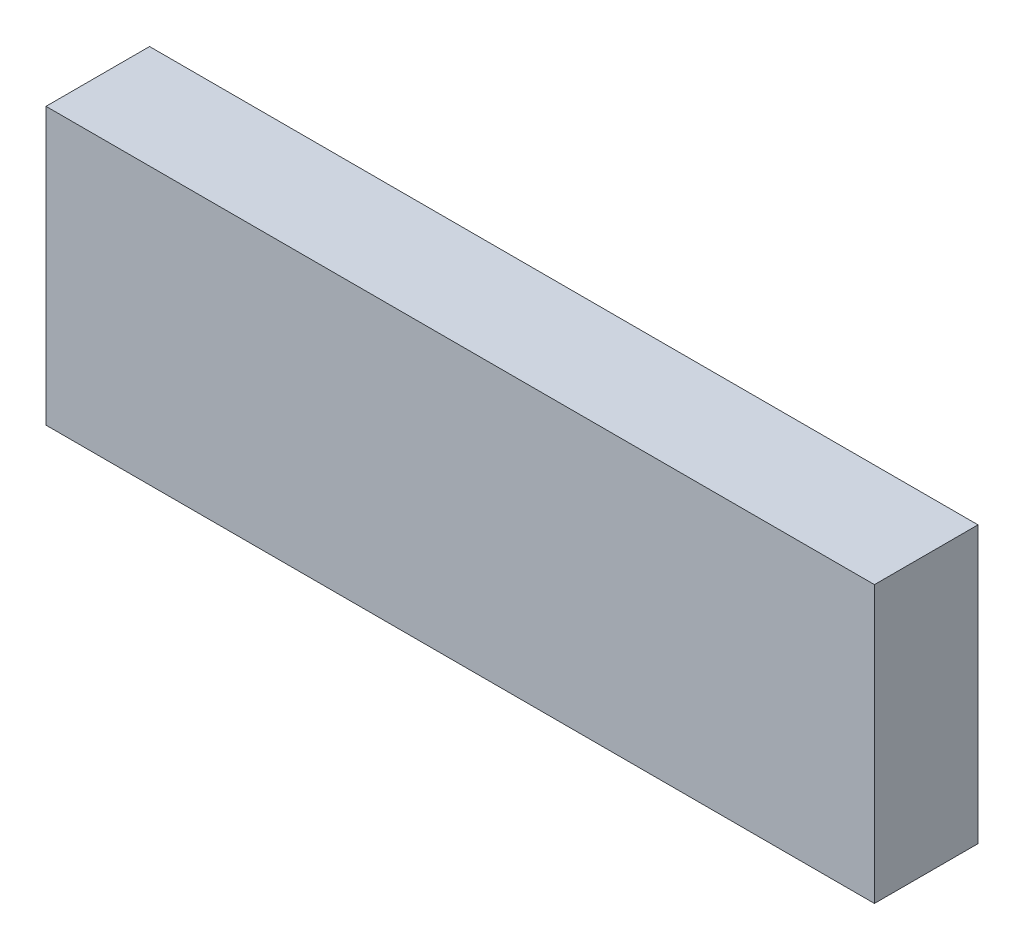
ISO-10303-21;
HEADER;
FILE_DESCRIPTION(('STEP AP214'),'2;1');
FILE_NAME('part.step','',(''),(''),'','','');
FILE_SCHEMA(('AUTOMOTIVE_DESIGN { 1 0 10303 214 1 1 1 1 }'));
ENDSEC;
DATA;
#1=APPLICATION_CONTEXT('core data for automotive mechanical design processes');
#2=APPLICATION_PROTOCOL_DEFINITION('international standard','automotive_design',2000,#1);
#3=PRODUCT_CONTEXT('',#1,'mechanical');
#4=PRODUCT('Part','Part','',(#3));
#5=PRODUCT_RELATED_PRODUCT_CATEGORY('part','',(#4));
#6=PRODUCT_DEFINITION_FORMATION('','',#4);
#7=PRODUCT_DEFINITION_CONTEXT('part definition',#1,'design');
#8=PRODUCT_DEFINITION('design','',#6,#7);
#9=PRODUCT_DEFINITION_SHAPE('','',#8);
#10=(LENGTH_UNIT() NAMED_UNIT(*) SI_UNIT(.MILLI.,.METRE.));
#11=(NAMED_UNIT(*) PLANE_ANGLE_UNIT() SI_UNIT($,.RADIAN.));
#12=(NAMED_UNIT(*) SI_UNIT($,.STERADIAN.) SOLID_ANGLE_UNIT());
#13=UNCERTAINTY_MEASURE_WITH_UNIT(LENGTH_MEASURE(1.E-05),#10,'distance_accuracy_value','');
#14=(GEOMETRIC_REPRESENTATION_CONTEXT(3) GLOBAL_UNCERTAINTY_ASSIGNED_CONTEXT((#13)) GLOBAL_UNIT_ASSIGNED_CONTEXT((#10,
#11,#12)) REPRESENTATION_CONTEXT('',''));
#15=CARTESIAN_POINT('',(0.,0.,0.));
#16=DIRECTION('',(0.,0.,1.));
#17=DIRECTION('',(1.,0.,0.));
#18=AXIS2_PLACEMENT_3D('',#15,#16,#17);
#19=CARTESIAN_POINT('',(7.84785073287162,-18.4999999999989,3.));
#20=DIRECTION('',(-1.,0.,0.));
#21=DIRECTION('',(0.,0.,1.));
#22=AXIS2_PLACEMENT_3D('',#19,#20,#21);
#23=PLANE('',#22);
#24=DIRECTION('',(0.,1.,0.));
#25=VECTOR('',#24,1.);
#26=CARTESIAN_POINT('',(7.84785073287162,-18.4999999999989,0.));
#27=LINE('',#26,#25);
#28=CARTESIAN_POINT('',(7.84785073287162,-18.4999999999989,0.));
#29=VERTEX_POINT('',#28);
#30=CARTESIAN_POINT('',(7.84785073287162,-10.4999999999989,0.));
#31=VERTEX_POINT('',#30);
#32=EDGE_CURVE('E95',#29,#31,#27,.T.);
#33=ORIENTED_EDGE('',*,*,#32,.T.);
#34=DIRECTION('',(0.,0.,-1.));
#35=VECTOR('',#34,1.);
#36=CARTESIAN_POINT('',(7.84785073287162,-10.4999999999989,3.));
#37=LINE('',#36,#35);
#38=CARTESIAN_POINT('',(7.84785073287162,-10.4999999999989,3.));
#39=VERTEX_POINT('',#38);
#40=EDGE_CURVE('E11',#39,#31,#37,.T.);
#41=ORIENTED_EDGE('',*,*,#40,.F.);
#42=DIRECTION('',(0.,1.,0.));
#43=VECTOR('',#42,1.);
#44=CARTESIAN_POINT('',(7.84785073287162,-18.4999999999989,3.));
#45=LINE('',#44,#43);
#46=CARTESIAN_POINT('',(7.84785073287162,-18.4999999999989,3.));
#47=VERTEX_POINT('',#46);
#48=EDGE_CURVE('E83',#47,#39,#45,.T.);
#49=ORIENTED_EDGE('',*,*,#48,.F.);
#50=DIRECTION('',(0.,0.,-1.));
#51=VECTOR('',#50,1.);
#52=CARTESIAN_POINT('',(7.84785073287162,-18.4999999999989,3.));
#53=LINE('',#52,#51);
#54=EDGE_CURVE('E91',#47,#29,#53,.T.);
#55=ORIENTED_EDGE('',*,*,#54,.T.);
#56=EDGE_LOOP('',(#33,#41,#49,#55));
#57=FACE_BOUND('',#56,.T.);
#58=ADVANCED_FACE('F32',(#57),#23,.F.);
#59=CARTESIAN_POINT('',(7.84785073287162,-10.4999999999989,3.));
#60=DIRECTION('',(0.,-1.,0.));
#61=DIRECTION('',(1.,0.,0.));
#62=AXIS2_PLACEMENT_3D('',#59,#60,#61);
#63=PLANE('',#62);
#64=DIRECTION('',(-1.,0.,0.));
#65=VECTOR('',#64,1.);
#66=CARTESIAN_POINT('',(7.84785073287162,-10.4999999999989,0.));
#67=LINE('',#66,#65);
#68=CARTESIAN_POINT('',(-16.1521492671284,-10.4999999999989,0.));
#69=VERTEX_POINT('',#68);
#70=EDGE_CURVE('E87',#31,#69,#67,.T.);
#71=ORIENTED_EDGE('',*,*,#70,.T.);
#72=DIRECTION('',(0.,0.,-1.));
#73=VECTOR('',#72,1.);
#74=CARTESIAN_POINT('',(-16.1521492671284,-10.4999999999989,3.));
#75=LINE('',#74,#73);
#76=CARTESIAN_POINT('',(-16.1521492671284,-10.4999999999989,3.));
#77=VERTEX_POINT('',#76);
#78=EDGE_CURVE('E40',#77,#69,#75,.T.);
#79=ORIENTED_EDGE('',*,*,#78,.F.);
#80=DIRECTION('',(-1.,0.,0.));
#81=VECTOR('',#80,1.);
#82=CARTESIAN_POINT('',(7.84785073287162,-10.4999999999989,3.));
#83=LINE('',#82,#81);
#84=EDGE_CURVE('E78',#39,#77,#83,.T.);
#85=ORIENTED_EDGE('',*,*,#84,.F.);
#86=ORIENTED_EDGE('',*,*,#40,.T.);
#87=EDGE_LOOP('',(#71,#79,#85,#86));
#88=FACE_BOUND('',#87,.T.);
#89=ADVANCED_FACE('F86',(#88),#63,.F.);
#90=CARTESIAN_POINT('',(-16.1521492671284,-18.4999999999989,3.));
#91=DIRECTION('',(1.,0.,0.));
#92=DIRECTION('',(0.,0.,-1.));
#93=AXIS2_PLACEMENT_3D('',#90,#91,#92);
#94=PLANE('',#93);
#95=DIRECTION('',(0.,-1.,0.));
#96=VECTOR('',#95,1.);
#97=CARTESIAN_POINT('',(-16.1521492671284,-18.4999999999989,0.));
#98=LINE('',#97,#96);
#99=CARTESIAN_POINT('',(-16.1521492671284,-18.4999999999989,0.));
#100=VERTEX_POINT('',#99);
#101=EDGE_CURVE('E65',#69,#100,#98,.T.);
#102=ORIENTED_EDGE('',*,*,#101,.T.);
#103=DIRECTION('',(0.,0.,-1.));
#104=VECTOR('',#103,1.);
#105=CARTESIAN_POINT('',(-16.1521492671284,-18.4999999999989,3.));
#106=LINE('',#105,#104);
#107=CARTESIAN_POINT('',(-16.1521492671284,-18.4999999999989,3.));
#108=VERTEX_POINT('',#107);
#109=EDGE_CURVE('E88',#108,#100,#106,.T.);
#110=ORIENTED_EDGE('',*,*,#109,.F.);
#111=DIRECTION('',(0.,-1.,0.));
#112=VECTOR('',#111,1.);
#113=CARTESIAN_POINT('',(-16.1521492671284,-18.4999999999989,3.));
#114=LINE('',#113,#112);
#115=EDGE_CURVE('E81',#77,#108,#114,.T.);
#116=ORIENTED_EDGE('',*,*,#115,.F.);
#117=ORIENTED_EDGE('',*,*,#78,.T.);
#118=EDGE_LOOP('',(#102,#110,#116,#117));
#119=FACE_BOUND('',#118,.T.);
#120=ADVANCED_FACE('F89',(#119),#94,.F.);
#121=CARTESIAN_POINT('',(7.84785073287162,-18.4999999999989,3.));
#122=DIRECTION('',(0.,1.,0.));
#123=DIRECTION('',(0.,0.,1.));
#124=AXIS2_PLACEMENT_3D('',#121,#122,#123);
#125=PLANE('',#124);
#126=DIRECTION('',(1.,0.,0.));
#127=VECTOR('',#126,1.);
#128=CARTESIAN_POINT('',(7.84785073287162,-18.4999999999989,0.));
#129=LINE('',#128,#127);
#130=EDGE_CURVE('E71',#100,#29,#129,.T.);
#131=ORIENTED_EDGE('',*,*,#130,.T.);
#132=ORIENTED_EDGE('',*,*,#54,.F.);
#133=DIRECTION('',(1.,0.,0.));
#134=VECTOR('',#133,1.);
#135=CARTESIAN_POINT('',(7.84785073287162,-18.4999999999989,3.));
#136=LINE('',#135,#134);
#137=EDGE_CURVE('E48',#108,#47,#136,.T.);
#138=ORIENTED_EDGE('',*,*,#137,.F.);
#139=ORIENTED_EDGE('',*,*,#109,.T.);
#140=EDGE_LOOP('',(#131,#132,#138,#139));
#141=FACE_BOUND('',#140,.T.);
#142=ADVANCED_FACE('F102',(#141),#125,.F.);
#143=CARTESIAN_POINT('',(7.84785073287162,-18.4999999999989,3.));
#144=DIRECTION('',(0.,0.,1.));
#145=DIRECTION('',(1.,0.,0.));
#146=AXIS2_PLACEMENT_3D('',#143,#144,#145);
#147=PLANE('',#146);
#148=ORIENTED_EDGE('',*,*,#48,.T.);
#149=ORIENTED_EDGE('',*,*,#84,.T.);
#150=ORIENTED_EDGE('',*,*,#115,.T.);
#151=ORIENTED_EDGE('',*,*,#137,.T.);
#152=EDGE_LOOP('',(#148,#149,#150,#151));
#153=FACE_BOUND('',#152,.T.);
#154=ADVANCED_FACE('F79',(#153),#147,.T.);
#155=CARTESIAN_POINT('',(7.84785073287162,-18.4999999999989,0.));
#156=DIRECTION('',(0.,0.,1.));
#157=DIRECTION('',(1.,0.,0.));
#158=AXIS2_PLACEMENT_3D('',#155,#156,#157);
#159=PLANE('',#158);
#160=ORIENTED_EDGE('',*,*,#32,.F.);
#161=ORIENTED_EDGE('',*,*,#130,.F.);
#162=ORIENTED_EDGE('',*,*,#101,.F.);
#163=ORIENTED_EDGE('',*,*,#70,.F.);
#164=EDGE_LOOP('',(#160,#161,#162,#163));
#165=FACE_BOUND('',#164,.T.);
#166=ADVANCED_FACE('F105',(#165),#159,.F.);
#167=CLOSED_SHELL('',(#58,#89,#120,#142,#154,#166));
#168=MANIFOLD_SOLID_BREP('B2',#167);
#169=ADVANCED_BREP_SHAPE_REPRESENTATION('',(#18,#168),#14);
#170=SHAPE_DEFINITION_REPRESENTATION(#9,#169);
ENDSEC;
END-ISO-10303-21;
